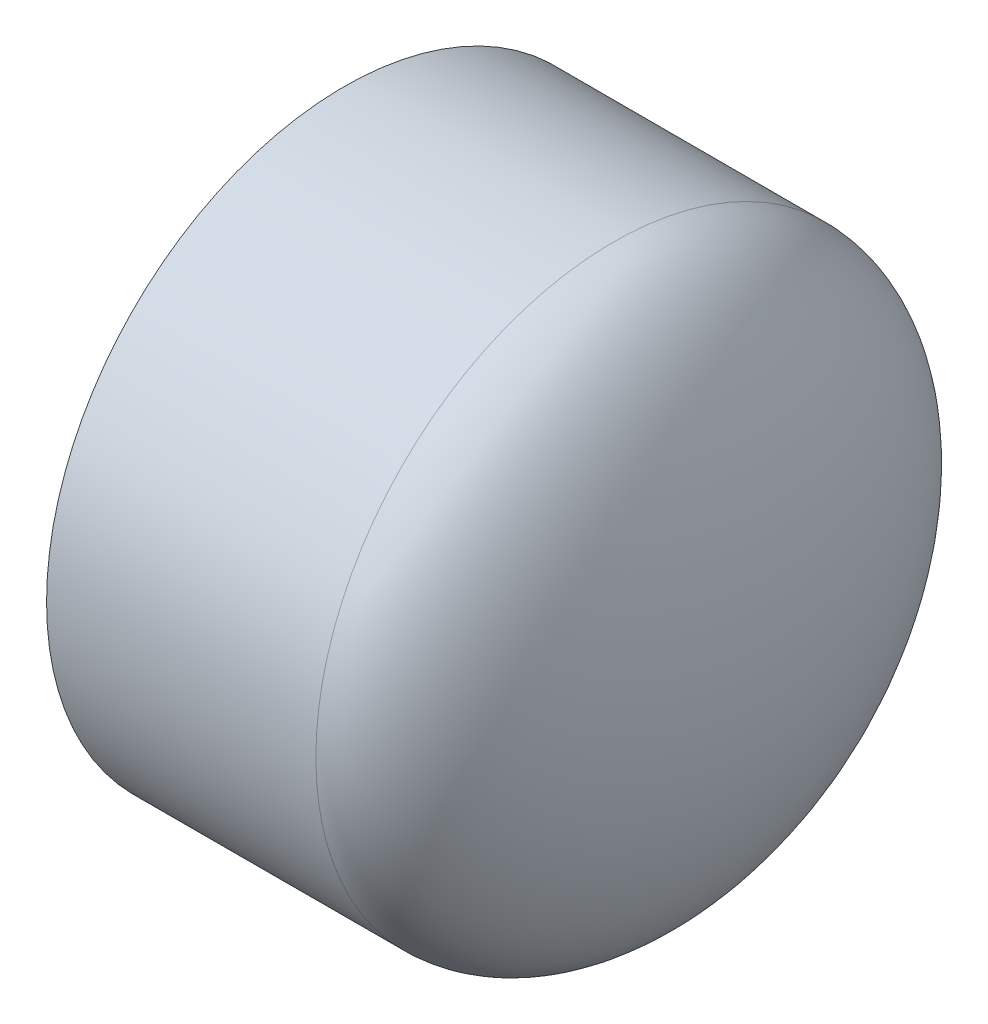
ISO-10303-21;
HEADER;
FILE_DESCRIPTION(('STEP AP214'),'2;1');
FILE_NAME('part.step','',(''),(''),'','','');
FILE_SCHEMA(('AUTOMOTIVE_DESIGN { 1 0 10303 214 1 1 1 1 }'));
ENDSEC;
DATA;
#1=APPLICATION_CONTEXT('core data for automotive mechanical design processes');
#2=APPLICATION_PROTOCOL_DEFINITION('international standard','automotive_design',2000,#1);
#3=PRODUCT_CONTEXT('',#1,'mechanical');
#4=PRODUCT('Part','Part','',(#3));
#5=PRODUCT_RELATED_PRODUCT_CATEGORY('part','',(#4));
#6=PRODUCT_DEFINITION_FORMATION('','',#4);
#7=PRODUCT_DEFINITION_CONTEXT('part definition',#1,'design');
#8=PRODUCT_DEFINITION('design','',#6,#7);
#9=PRODUCT_DEFINITION_SHAPE('','',#8);
#10=(LENGTH_UNIT() NAMED_UNIT(*) SI_UNIT(.MILLI.,.METRE.));
#11=(NAMED_UNIT(*) PLANE_ANGLE_UNIT() SI_UNIT($,.RADIAN.));
#12=(NAMED_UNIT(*) SI_UNIT($,.STERADIAN.) SOLID_ANGLE_UNIT());
#13=UNCERTAINTY_MEASURE_WITH_UNIT(LENGTH_MEASURE(1.E-05),#10,'distance_accuracy_value','');
#14=(GEOMETRIC_REPRESENTATION_CONTEXT(3) GLOBAL_UNCERTAINTY_ASSIGNED_CONTEXT((#13)) GLOBAL_UNIT_ASSIGNED_CONTEXT((#10,
#11,#12)) REPRESENTATION_CONTEXT('',''));
#15=CARTESIAN_POINT('',(0.,0.,0.));
#16=DIRECTION('',(0.,0.,1.));
#17=DIRECTION('',(1.,0.,0.));
#18=AXIS2_PLACEMENT_3D('',#15,#16,#17);
#19=CARTESIAN_POINT('',(-25.4,0.,0.));
#20=DIRECTION('',(0.,0.,1.));
#21=DIRECTION('',(0.,1.,0.));
#22=AXIS2_PLACEMENT_3D('',#19,#20,#21);
#23=ELLIPSE('',#22,54.737,25.4);
#24=TRIMMED_CURVE('',#23,(PARAMETER_VALUE(1.5707963267949)),(PARAMETER_VALUE(4.71238898038469)),
.T.,.PARAMETER.);
#25=CARTESIAN_POINT('',(-74.93,0.,0.));
#26=DIRECTION('',(-1.,0.,0.));
#27=AXIS1_PLACEMENT('',#25,#26);
#28=SURFACE_OF_REVOLUTION('',#24,#27);
#29=CARTESIAN_POINT('',(0.,0.,0.));
#30=VERTEX_POINT('',#29);
#31=VERTEX_LOOP('',#30);
#32=FACE_BOUND('',#31,.T.);
#33=CARTESIAN_POINT('',(-25.4,0.,0.));
#34=DIRECTION('',(-1.,0.,0.));
#35=DIRECTION('',(0.,0.,1.));
#36=AXIS2_PLACEMENT_3D('',#33,#34,#35);
#37=CIRCLE('',#36,54.737);
#38=CARTESIAN_POINT('',(-25.4,0.,54.737));
#39=VERTEX_POINT('',#38);
#40=EDGE_CURVE('E51',#39,#39,#37,.T.);
#41=ORIENTED_EDGE('',*,*,#40,.F.);
#42=EDGE_LOOP('',(#41));
#43=FACE_BOUND('',#42,.T.);
#44=ADVANCED_FACE('F32',(#32,#43),#28,.F.);
#45=CARTESIAN_POINT('',(-25.4,0.,0.));
#46=DIRECTION('',(0.,0.,-1.));
#47=DIRECTION('',(0.,-1.,0.));
#48=AXIS2_PLACEMENT_3D('',#45,#46,#47);
#49=ELLIPSE('',#48,44.3484,15.0114);
#50=TRIMMED_CURVE('',#49,(PARAMETER_VALUE(4.71238898038469)),
(PARAMETER_VALUE(7.85398163397448)),.T.,.PARAMETER.);
#51=CARTESIAN_POINT('',(-74.93,0.,0.));
#52=DIRECTION('',(-1.,0.,0.));
#53=AXIS1_PLACEMENT('',#51,#52);
#54=SURFACE_OF_REVOLUTION('',#50,#53);
#55=CARTESIAN_POINT('',(-25.4,0.,0.));
#56=DIRECTION('',(-1.,0.,0.));
#57=DIRECTION('',(0.,0.,1.));
#58=AXIS2_PLACEMENT_3D('',#55,#56,#57);
#59=CIRCLE('',#58,44.3484);
#60=CARTESIAN_POINT('',(-25.4,0.,44.3484));
#61=VERTEX_POINT('',#60);
#62=EDGE_CURVE('E11',#61,#61,#59,.T.);
#63=ORIENTED_EDGE('',*,*,#62,.T.);
#64=EDGE_LOOP('',(#63));
#65=FACE_BOUND('',#64,.T.);
#66=CARTESIAN_POINT('',(-10.3886,0.,0.));
#67=VERTEX_POINT('',#66);
#68=VERTEX_LOOP('',#67);
#69=FACE_BOUND('',#68,.T.);
#70=ADVANCED_FACE('F48',(#65,#69),#54,.F.);
#71=CARTESIAN_POINT('',(-25.4,0.,0.));
#72=DIRECTION('',(-1.,0.,0.));
#73=DIRECTION('',(0.,0.,1.));
#74=AXIS2_PLACEMENT_3D('',#71,#72,#73);
#75=CONICAL_SURFACE('',#74,44.3484,0.00615376847392405);
#76=CARTESIAN_POINT('',(-74.93,0.,0.));
#77=DIRECTION('',(-1.,0.,0.));
#78=DIRECTION('',(0.,0.,1.));
#79=AXIS2_PLACEMENT_3D('',#76,#77,#78);
#80=CIRCLE('',#79,44.6532);
#81=CARTESIAN_POINT('',(-74.93,0.,44.6532));
#82=VERTEX_POINT('',#81);
#83=EDGE_CURVE('E40',#82,#82,#80,.T.);
#84=ORIENTED_EDGE('',*,*,#83,.T.);
#85=EDGE_LOOP('',(#84));
#86=FACE_BOUND('',#85,.T.);
#87=ORIENTED_EDGE('',*,*,#62,.F.);
#88=EDGE_LOOP('',(#87));
#89=FACE_BOUND('',#88,.T.);
#90=ADVANCED_FACE('F62',(#86,#89),#75,.F.);
#91=CARTESIAN_POINT('',(-74.93,-54.737,0.));
#92=DIRECTION('',(-1.,0.,0.));
#93=DIRECTION('',(0.,0.,1.));
#94=AXIS2_PLACEMENT_3D('',#91,#92,#93);
#95=PLANE('',#94);
#96=CARTESIAN_POINT('',(-74.93,0.,0.));
#97=DIRECTION('',(-1.,0.,0.));
#98=DIRECTION('',(0.,0.,1.));
#99=AXIS2_PLACEMENT_3D('',#96,#97,#98);
#100=CIRCLE('',#99,54.737);
#101=CARTESIAN_POINT('',(-74.93,0.,54.737));
#102=VERTEX_POINT('',#101);
#103=EDGE_CURVE('E53',#102,#102,#100,.T.);
#104=ORIENTED_EDGE('',*,*,#103,.T.);
#105=EDGE_LOOP('',(#104));
#106=FACE_BOUND('',#105,.T.);
#107=ORIENTED_EDGE('',*,*,#83,.F.);
#108=EDGE_LOOP('',(#107));
#109=FACE_BOUND('',#108,.T.);
#110=ADVANCED_FACE('F65',(#106,#109),#95,.T.);
#111=CARTESIAN_POINT('',(-74.93,0.,0.));
#112=DIRECTION('',(-1.,0.,0.));
#113=DIRECTION('',(0.,0.,1.));
#114=AXIS2_PLACEMENT_3D('',#111,#112,#113);
#115=CYLINDRICAL_SURFACE('',#114,54.737);
#116=ORIENTED_EDGE('',*,*,#40,.T.);
#117=EDGE_LOOP('',(#116));
#118=FACE_BOUND('',#117,.T.);
#119=ORIENTED_EDGE('',*,*,#103,.F.);
#120=EDGE_LOOP('',(#119));
#121=FACE_BOUND('',#120,.T.);
#122=ADVANCED_FACE('F67',(#118,#121),#115,.T.);
#123=CLOSED_SHELL('',(#44,#70,#90,#110,#122));
#124=MANIFOLD_SOLID_BREP('B2',#123);
#125=ADVANCED_BREP_SHAPE_REPRESENTATION('',(#18,#124),#14);
#126=SHAPE_DEFINITION_REPRESENTATION(#9,#125);
ENDSEC;
END-ISO-10303-21;
